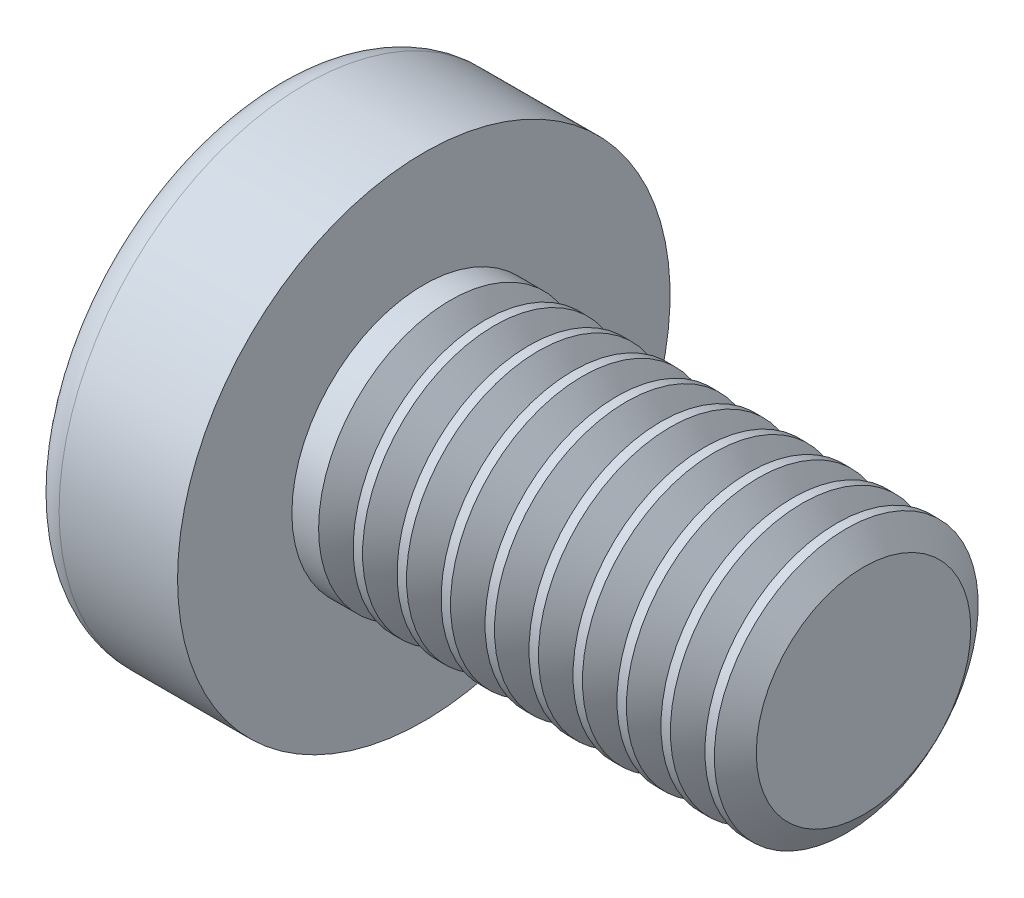
ISO-10303-21;
HEADER;
FILE_DESCRIPTION(('STEP AP214'),'2;1');
FILE_NAME('part.step','',(''),(''),'','','');
FILE_SCHEMA(('AUTOMOTIVE_DESIGN { 1 0 10303 214 1 1 1 1 }'));
ENDSEC;
DATA;
#1=APPLICATION_CONTEXT('core data for automotive mechanical design processes');
#2=APPLICATION_PROTOCOL_DEFINITION('international standard','automotive_design',2000,#1);
#3=PRODUCT_CONTEXT('',#1,'mechanical');
#4=PRODUCT('Part','Part','',(#3));
#5=PRODUCT_RELATED_PRODUCT_CATEGORY('part','',(#4));
#6=PRODUCT_DEFINITION_FORMATION('','',#4);
#7=PRODUCT_DEFINITION_CONTEXT('part definition',#1,'design');
#8=PRODUCT_DEFINITION('design','',#6,#7);
#9=PRODUCT_DEFINITION_SHAPE('','',#8);
#10=(LENGTH_UNIT() NAMED_UNIT(*) SI_UNIT(.MILLI.,.METRE.));
#11=(NAMED_UNIT(*) PLANE_ANGLE_UNIT() SI_UNIT($,.RADIAN.));
#12=(NAMED_UNIT(*) SI_UNIT($,.STERADIAN.) SOLID_ANGLE_UNIT());
#13=UNCERTAINTY_MEASURE_WITH_UNIT(LENGTH_MEASURE(1.E-05),#10,'distance_accuracy_value','');
#14=(GEOMETRIC_REPRESENTATION_CONTEXT(3) GLOBAL_UNCERTAINTY_ASSIGNED_CONTEXT((#13)) GLOBAL_UNIT_ASSIGNED_CONTEXT((#10,
#11,#12)) REPRESENTATION_CONTEXT('',''));
#15=CARTESIAN_POINT('',(0.,0.,0.));
#16=DIRECTION('',(0.,0.,1.));
#17=DIRECTION('',(1.,0.,0.));
#18=AXIS2_PLACEMENT_3D('',#15,#16,#17);
#19=CARTESIAN_POINT('',(5.,0.,0.));
#20=DIRECTION('',(-1.,0.,0.));
#21=DIRECTION('',(0.,1.,0.));
#22=AXIS2_PLACEMENT_3D('',#19,#20,#21);
#23=SPHERICAL_SURFACE('',#22,5.);
#24=CARTESIAN_POINT('',(0.74715070681048,0.,0.));
#25=DIRECTION('',(-1.,0.,0.));
#26=DIRECTION('',(0.,0.,1.));
#27=AXIS2_PLACEMENT_3D('',#24,#25,#26);
#28=CIRCLE('',#27,2.62931034482758);
#29=CARTESIAN_POINT('',(0.74715070681048,0.,2.62931034482758));
#30=VERTEX_POINT('',#29);
#31=EDGE_CURVE('E134',#30,#30,#28,.T.);
#32=ORIENTED_EDGE('',*,*,#31,.T.);
#33=EDGE_LOOP('',(#32));
#34=FACE_BOUND('',#33,.T.);
#35=CARTESIAN_POINT('',(4.98382636322272,-0.153868112043298,0.));
#36=DIRECTION('',(-0.104537710696287,-0.994520923380891,0.));
#37=DIRECTION('',(0.994520923380891,-0.104537710696287,0.));
#38=AXIS2_PLACEMENT_3D('',#35,#36,#37);
#39=CIRCLE('',#38,4.99760572850336);
#40=CARTESIAN_POINT('',(0.188596138461545,0.350175974082162,1.31444652548076));
#41=VERTEX_POINT('',#40);
#42=CARTESIAN_POINT('',(0.0270341343313624,0.367158343834486,0.367158343834487));
#43=VERTEX_POINT('',#42);
#44=EDGE_CURVE('E165',#41,#43,#39,.T.);
#45=ORIENTED_EDGE('',*,*,#44,.F.);
#46=CARTESIAN_POINT('',(3.98403090792016,0.,-1.41352221506761));
#47=DIRECTION('',(0.583636048152575,0.,0.812015371342713));
#48=DIRECTION('',(0.812015371342714,0.,-0.583636048152575));
#49=AXIS2_PLACEMENT_3D('',#46,#47,#48);
#50=CIRCLE('',#49,4.68719124331927);
#51=CARTESIAN_POINT('',(0.188596138461545,-0.350175974082171,1.31444652548076));
#52=VERTEX_POINT('',#51);
#53=EDGE_CURVE('E133',#41,#52,#50,.T.);
#54=ORIENTED_EDGE('',*,*,#53,.T.);
#55=CARTESIAN_POINT('',(4.98382636322272,0.153868112043297,0.));
#56=DIRECTION('',(-0.104537710696287,0.994520923380891,0.));
#57=DIRECTION('',(-0.994520923380891,-0.104537710696287,0.));
#58=AXIS2_PLACEMENT_3D('',#55,#56,#57);
#59=CIRCLE('',#58,4.99760572850336);
#60=CARTESIAN_POINT('',(0.0270341343313616,-0.367158343834489,0.367158343834487));
#61=VERTEX_POINT('',#60);
#62=EDGE_CURVE('E89',#61,#52,#59,.T.);
#63=ORIENTED_EDGE('',*,*,#62,.F.);
#64=CARTESIAN_POINT('',(4.98382636322272,0.,-0.153868112043297));
#65=DIRECTION('',(-0.104537710696287,0.,-0.994520923380891));
#66=DIRECTION('',(-0.994520923380891,0.,0.104537710696287));
#67=AXIS2_PLACEMENT_3D('',#64,#65,#66);
#68=CIRCLE('',#67,4.99760572850336);
#69=CARTESIAN_POINT('',(0.188596138461543,-1.31444652548077,0.350175974082167));
#70=VERTEX_POINT('',#69);
#71=EDGE_CURVE('E114',#70,#61,#68,.T.);
#72=ORIENTED_EDGE('',*,*,#71,.F.);
#73=CARTESIAN_POINT('',(3.98403090792016,1.41352221506761,0.));
#74=DIRECTION('',(0.583636048152575,-0.812015371342713,0.));
#75=DIRECTION('',(0.812015371342714,0.583636048152575,0.));
#76=AXIS2_PLACEMENT_3D('',#73,#74,#75);
#77=CIRCLE('',#76,4.68719124331927);
#78=CARTESIAN_POINT('',(0.188596138461543,-1.31444652548077,-0.350175974082167));
#79=VERTEX_POINT('',#78);
#80=EDGE_CURVE('E122',#70,#79,#77,.T.);
#81=ORIENTED_EDGE('',*,*,#80,.T.);
#82=CARTESIAN_POINT('',(4.98382636322272,0.,0.153868112043298));
#83=DIRECTION('',(-0.104537710696287,0.,0.994520923380891));
#84=DIRECTION('',(0.994520923380891,0.,0.104537710696287));
#85=AXIS2_PLACEMENT_3D('',#82,#83,#84);
#86=CIRCLE('',#85,4.99760572850336);
#87=CARTESIAN_POINT('',(0.0270341343313616,-0.367158343834486,-0.367158343834487));
#88=VERTEX_POINT('',#87);
#89=EDGE_CURVE('E32',#88,#79,#86,.T.);
#90=ORIENTED_EDGE('',*,*,#89,.F.);
#91=CARTESIAN_POINT('',(0.188596138461545,-0.350175974082162,-1.31444652548077));
#92=VERTEX_POINT('',#91);
#93=EDGE_CURVE('E172',#92,#88,#59,.T.);
#94=ORIENTED_EDGE('',*,*,#93,.F.);
#95=CARTESIAN_POINT('',(3.98403090792016,0.,1.41352221506761));
#96=DIRECTION('',(0.583636048152575,0.,-0.812015371342713));
#97=DIRECTION('',(-0.812015371342714,0.,-0.583636048152575));
#98=AXIS2_PLACEMENT_3D('',#95,#96,#97);
#99=CIRCLE('',#98,4.68719124331927);
#100=CARTESIAN_POINT('',(0.188596138461545,0.350175974082172,-1.31444652548076));
#101=VERTEX_POINT('',#100);
#102=EDGE_CURVE('E115',#92,#101,#99,.T.);
#103=ORIENTED_EDGE('',*,*,#102,.T.);
#104=CARTESIAN_POINT('',(0.0270341343313624,0.367158343834489,-0.367158343834487));
#105=VERTEX_POINT('',#104);
#106=EDGE_CURVE('E160',#105,#101,#39,.T.);
#107=ORIENTED_EDGE('',*,*,#106,.F.);
#108=CARTESIAN_POINT('',(0.188596138461545,1.31444652548076,-0.350175974082167));
#109=VERTEX_POINT('',#108);
#110=EDGE_CURVE('E25',#109,#105,#86,.T.);
#111=ORIENTED_EDGE('',*,*,#110,.F.);
#112=CARTESIAN_POINT('',(3.98403090792016,-1.41352221506761,0.));
#113=DIRECTION('',(0.583636048152575,0.812015371342713,0.));
#114=DIRECTION('',(-0.812015371342714,0.583636048152575,0.));
#115=AXIS2_PLACEMENT_3D('',#112,#113,#114);
#116=CIRCLE('',#115,4.68719124331927);
#117=CARTESIAN_POINT('',(0.188596138461545,1.31444652548076,0.350175974082167));
#118=VERTEX_POINT('',#117);
#119=EDGE_CURVE('E11',#109,#118,#116,.T.);
#120=ORIENTED_EDGE('',*,*,#119,.T.);
#121=EDGE_CURVE('E148',#43,#118,#68,.T.);
#122=ORIENTED_EDGE('',*,*,#121,.F.);
#123=EDGE_LOOP('',(#45,#54,#63,#72,#81,#90,#94,#103,#107,#111,#120,#122));
#124=FACE_BOUND('',#123,.T.);
#125=ADVANCED_FACE('F17',(#34,#124),#23,.T.);
#126=CARTESIAN_POINT('',(2.01739130434783,0.,-0.157944664031621));
#127=DIRECTION('',(-0.104537710696287,0.,0.994520923380891));
#128=DIRECTION('',(0.994520923380891,0.,0.104537710696287));
#129=AXIS2_PLACEMENT_3D('',#126,#127,#128);
#130=PLANE('',#129);
#131=ORIENTED_EDGE('',*,*,#110,.T.);
#132=DIRECTION('',(0.989130931836555,-0.103971149085093,0.103971149085092));
#133=VECTOR('',#132,1.);
#134=CARTESIAN_POINT('',(2.03363450411053,0.156237282238383,-0.156237282238382));
#135=LINE('',#134,#133);
#136=CARTESIAN_POINT('',(1.76,0.185,-0.185));
#137=VERTEX_POINT('',#136);
#138=EDGE_CURVE('E154',#105,#137,#135,.T.);
#139=ORIENTED_EDGE('',*,*,#138,.T.);
#140=DIRECTION('',(0.809073553388531,-0.581521616498006,0.0850446632823171));
#141=VECTOR('',#140,1.);
#142=CARTESIAN_POINT('',(0.,1.45,-0.37));
#143=LINE('',#142,#141);
#144=EDGE_CURVE('E138',#109,#137,#143,.T.);
#145=ORIENTED_EDGE('',*,*,#144,.F.);
#146=EDGE_LOOP('',(#131,#139,#145));
#147=FACE_BOUND('',#146,.T.);
#148=ADVANCED_FACE('F153',(#147),#130,.T.);
#149=DIRECTION('',(0.809073553388531,0.581521616498006,0.0850446632823171));
#150=VECTOR('',#149,1.);
#151=CARTESIAN_POINT('',(0.,-1.45,-0.37));
#152=LINE('',#151,#150);
#153=CARTESIAN_POINT('',(1.76,-0.185,-0.185));
#154=VERTEX_POINT('',#153);
#155=EDGE_CURVE('E123',#79,#154,#152,.T.);
#156=ORIENTED_EDGE('',*,*,#155,.T.);
#157=DIRECTION('',(-0.989130931836555,-0.103971149085092,-0.103971149085092));
#158=VECTOR('',#157,1.);
#159=CARTESIAN_POINT('',(2.03363450411053,-0.156237282238382,-0.156237282238382));
#160=LINE('',#159,#158);
#161=EDGE_CURVE('E175',#154,#88,#160,.T.);
#162=ORIENTED_EDGE('',*,*,#161,.T.);
#163=ORIENTED_EDGE('',*,*,#89,.T.);
#164=EDGE_LOOP('',(#156,#162,#163));
#165=FACE_BOUND('',#164,.T.);
#166=ADVANCED_FACE('F291',(#165),#130,.T.);
#167=CARTESIAN_POINT('',(2.01739130434783,0.,0.157944664031621));
#168=DIRECTION('',(-0.104537710696287,0.,-0.994520923380891));
#169=DIRECTION('',(-0.994520923380891,0.,0.104537710696287));
#170=AXIS2_PLACEMENT_3D('',#167,#168,#169);
#171=PLANE('',#170);
#172=DIRECTION('',(0.809073553388531,-0.581521616498006,-0.085044663282317));
#173=VECTOR('',#172,1.);
#174=CARTESIAN_POINT('',(0.,1.45,0.37));
#175=LINE('',#174,#173);
#176=CARTESIAN_POINT('',(1.76,0.185,0.185));
#177=VERTEX_POINT('',#176);
#178=EDGE_CURVE('E741',#118,#177,#175,.T.);
#179=ORIENTED_EDGE('',*,*,#178,.T.);
#180=DIRECTION('',(-0.989130931836555,0.103971149085092,0.103971149085092));
#181=VECTOR('',#180,1.);
#182=CARTESIAN_POINT('',(2.03363450411053,0.156237282238381,0.156237282238383));
#183=LINE('',#182,#181);
#184=EDGE_CURVE('E169',#177,#43,#183,.T.);
#185=ORIENTED_EDGE('',*,*,#184,.T.);
#186=ORIENTED_EDGE('',*,*,#121,.T.);
#187=EDGE_LOOP('',(#179,#185,#186));
#188=FACE_BOUND('',#187,.T.);
#189=ADVANCED_FACE('F321',(#188),#171,.T.);
#190=ORIENTED_EDGE('',*,*,#71,.T.);
#191=DIRECTION('',(0.989130931836555,0.103971149085092,-0.103971149085092));
#192=VECTOR('',#191,1.);
#193=CARTESIAN_POINT('',(2.03363450411053,-0.156237282238383,0.156237282238383));
#194=LINE('',#193,#192);
#195=CARTESIAN_POINT('',(1.76,-0.185,0.185));
#196=VERTEX_POINT('',#195);
#197=EDGE_CURVE('E87',#61,#196,#194,.T.);
#198=ORIENTED_EDGE('',*,*,#197,.T.);
#199=DIRECTION('',(0.809073553388531,0.581521616498006,-0.0850446632823169));
#200=VECTOR('',#199,1.);
#201=CARTESIAN_POINT('',(0.,-1.45,0.37));
#202=LINE('',#201,#200);
#203=EDGE_CURVE('E112',#70,#196,#202,.T.);
#204=ORIENTED_EDGE('',*,*,#203,.F.);
#205=EDGE_LOOP('',(#190,#198,#204));
#206=FACE_BOUND('',#205,.T.);
#207=ADVANCED_FACE('F111',(#206),#171,.T.);
#208=CARTESIAN_POINT('',(-25.4,0.,0.));
#209=DIRECTION('',(-1.,0.,0.));
#210=DIRECTION('',(0.,0.,1.));
#211=AXIS2_PLACEMENT_3D('',#208,#209,#210);
#212=CYLINDRICAL_SURFACE('',#211,1.5);
#213=CARTESIAN_POINT('',(2.70359178553217,0.,0.));
#214=DIRECTION('',(-1.,0.,0.));
#215=DIRECTION('',(0.,-1.,0.));
#216=AXIS2_PLACEMENT_3D('',#213,#214,#215);
#217=CIRCLE('',#216,1.5);
#218=CARTESIAN_POINT('',(2.70359178553217,-1.5,0.));
#219=VERTEX_POINT('',#218);
#220=EDGE_CURVE('E187',#219,#219,#217,.T.);
#221=ORIENTED_EDGE('',*,*,#220,.T.);
#222=EDGE_LOOP('',(#221));
#223=FACE_BOUND('',#222,.T.);
#224=CARTESIAN_POINT('',(2.4,0.,0.));
#225=DIRECTION('',(-1.,0.,0.));
#226=DIRECTION('',(0.,0.,1.));
#227=AXIS2_PLACEMENT_3D('',#224,#225,#226);
#228=CIRCLE('',#227,1.5);
#229=CARTESIAN_POINT('',(2.4,0.,1.5));
#230=VERTEX_POINT('',#229);
#231=EDGE_CURVE('E144',#230,#230,#228,.T.);
#232=ORIENTED_EDGE('',*,*,#231,.F.);
#233=EDGE_LOOP('',(#232));
#234=FACE_BOUND('',#233,.T.);
#235=ADVANCED_FACE('F19',(#223,#234),#212,.T.);
#236=CARTESIAN_POINT('',(2.4,1.5,0.));
#237=DIRECTION('',(-1.,0.,0.));
#238=DIRECTION('',(0.,0.,1.));
#239=AXIS2_PLACEMENT_3D('',#236,#237,#238);
#240=PLANE('',#239);
#241=CARTESIAN_POINT('',(2.4,0.,0.));
#242=DIRECTION('',(-1.,0.,0.));
#243=DIRECTION('',(0.,0.,1.));
#244=AXIS2_PLACEMENT_3D('',#241,#242,#243);
#245=CIRCLE('',#244,2.8);
#246=CARTESIAN_POINT('',(2.4,0.,2.8));
#247=VERTEX_POINT('',#246);
#248=EDGE_CURVE('E141',#247,#247,#245,.T.);
#249=ORIENTED_EDGE('',*,*,#248,.F.);
#250=EDGE_LOOP('',(#249));
#251=FACE_BOUND('',#250,.T.);
#252=ORIENTED_EDGE('',*,*,#231,.T.);
#253=EDGE_LOOP('',(#252));
#254=FACE_BOUND('',#253,.T.);
#255=ADVANCED_FACE('F301',(#251,#254),#240,.F.);
#256=CARTESIAN_POINT('',(-25.4,0.,0.));
#257=DIRECTION('',(-1.,0.,0.));
#258=DIRECTION('',(0.,0.,1.));
#259=AXIS2_PLACEMENT_3D('',#256,#257,#258);
#260=CYLINDRICAL_SURFACE('',#259,2.8);
#261=ORIENTED_EDGE('',*,*,#248,.T.);
#262=EDGE_LOOP('',(#261));
#263=FACE_BOUND('',#262,.T.);
#264=CARTESIAN_POINT('',(1.05335585592012,0.,0.));
#265=DIRECTION('',(-1.,0.,0.));
#266=DIRECTION('',(0.,0.,1.));
#267=AXIS2_PLACEMENT_3D('',#264,#265,#266);
#268=CIRCLE('',#267,2.8);
#269=CARTESIAN_POINT('',(1.05335585592012,0.,2.8));
#270=VERTEX_POINT('',#269);
#271=EDGE_CURVE('E137',#270,#270,#268,.T.);
#272=ORIENTED_EDGE('',*,*,#271,.F.);
#273=EDGE_LOOP('',(#272));
#274=FACE_BOUND('',#273,.T.);
#275=ADVANCED_FACE('F298',(#263,#274),#260,.T.);
#276=CARTESIAN_POINT('',(1.05335585592012,0.,0.));
#277=DIRECTION('',(-1.,0.,0.));
#278=DIRECTION('',(0.,0.,1.));
#279=AXIS2_PLACEMENT_3D('',#276,#277,#278);
#280=TOROIDAL_SURFACE('',#279,2.44,0.36);
#281=ORIENTED_EDGE('',*,*,#271,.T.);
#282=EDGE_LOOP('',(#281));
#283=FACE_BOUND('',#282,.T.);
#284=ORIENTED_EDGE('',*,*,#31,.F.);
#285=EDGE_LOOP('',(#284));
#286=FACE_BOUND('',#285,.T.);
#287=ADVANCED_FACE('F294',(#283,#286),#280,.T.);
#288=CARTESIAN_POINT('',(1.76,0.185,0.185));
#289=DIRECTION('',(0.583636048152575,0.812015371342713,0.));
#290=DIRECTION('',(-0.812015371342714,0.583636048152575,0.));
#291=AXIS2_PLACEMENT_3D('',#288,#289,#290);
#292=PLANE('',#291);
#293=ORIENTED_EDGE('',*,*,#144,.T.);
#294=DIRECTION('',(0.,0.,-1.));
#295=VECTOR('',#294,1.);
#296=CARTESIAN_POINT('',(1.76,0.185,0.185));
#297=LINE('',#296,#295);
#298=EDGE_CURVE('E105',#177,#137,#297,.T.);
#299=ORIENTED_EDGE('',*,*,#298,.F.);
#300=ORIENTED_EDGE('',*,*,#178,.F.);
#301=ORIENTED_EDGE('',*,*,#119,.F.);
#302=EDGE_LOOP('',(#293,#299,#300,#301));
#303=FACE_BOUND('',#302,.T.);
#304=ADVANCED_FACE('F297',(#303),#292,.F.);
#305=CARTESIAN_POINT('',(1.76,-0.185,-0.185));
#306=DIRECTION('',(0.583636048152575,-0.812015371342713,0.));
#307=DIRECTION('',(0.812015371342714,0.583636048152575,0.));
#308=AXIS2_PLACEMENT_3D('',#305,#306,#307);
#309=PLANE('',#308);
#310=ORIENTED_EDGE('',*,*,#203,.T.);
#311=DIRECTION('',(0.,0.,1.));
#312=VECTOR('',#311,1.);
#313=CARTESIAN_POINT('',(1.76,-0.185,-0.185));
#314=LINE('',#313,#312);
#315=EDGE_CURVE('E104',#154,#196,#314,.T.);
#316=ORIENTED_EDGE('',*,*,#315,.F.);
#317=ORIENTED_EDGE('',*,*,#155,.F.);
#318=ORIENTED_EDGE('',*,*,#80,.F.);
#319=EDGE_LOOP('',(#310,#316,#317,#318));
#320=FACE_BOUND('',#319,.T.);
#321=ADVANCED_FACE('F119',(#320),#309,.F.);
#322=CARTESIAN_POINT('',(1.76,-0.185,-0.185));
#323=DIRECTION('',(1.,0.,0.));
#324=DIRECTION('',(0.,0.,-1.));
#325=AXIS2_PLACEMENT_3D('',#322,#323,#324);
#326=PLANE('',#325);
#327=DIRECTION('',(0.,1.,0.));
#328=VECTOR('',#327,1.);
#329=CARTESIAN_POINT('',(1.76,-0.185,-0.185));
#330=LINE('',#329,#328);
#331=EDGE_CURVE('E127',#154,#137,#330,.T.);
#332=ORIENTED_EDGE('',*,*,#331,.F.);
#333=ORIENTED_EDGE('',*,*,#315,.T.);
#334=DIRECTION('',(0.,-1.,0.));
#335=VECTOR('',#334,1.);
#336=CARTESIAN_POINT('',(1.76,0.185,0.185));
#337=LINE('',#336,#335);
#338=EDGE_CURVE('E96',#177,#196,#337,.T.);
#339=ORIENTED_EDGE('',*,*,#338,.F.);
#340=ORIENTED_EDGE('',*,*,#298,.T.);
#341=EDGE_LOOP('',(#332,#333,#339,#340));
#342=FACE_BOUND('',#341,.T.);
#343=ADVANCED_FACE('F125',(#342),#326,.F.);
#344=CARTESIAN_POINT('',(1.76,0.185,-0.185));
#345=DIRECTION('',(0.583636048152575,0.,-0.812015371342713));
#346=DIRECTION('',(0.812015371342714,0.,0.583636048152575));
#347=AXIS2_PLACEMENT_3D('',#344,#345,#346);
#348=PLANE('',#347);
#349=DIRECTION('',(0.809073553388531,0.0850446632823149,0.581521616498007));
#350=VECTOR('',#349,1.);
#351=CARTESIAN_POINT('',(0.,-0.369999999999994,-1.45));
#352=LINE('',#351,#350);
#353=EDGE_CURVE('E180',#92,#154,#352,.T.);
#354=ORIENTED_EDGE('',*,*,#353,.T.);
#355=ORIENTED_EDGE('',*,*,#331,.T.);
#356=DIRECTION('',(0.809073553388531,-0.0850446632823192,0.581521616498006));
#357=VECTOR('',#356,1.);
#358=CARTESIAN_POINT('',(0.,0.370000000000005,-1.45));
#359=LINE('',#358,#357);
#360=EDGE_CURVE('E93',#101,#137,#359,.T.);
#361=ORIENTED_EDGE('',*,*,#360,.F.);
#362=ORIENTED_EDGE('',*,*,#102,.F.);
#363=EDGE_LOOP('',(#354,#355,#361,#362));
#364=FACE_BOUND('',#363,.T.);
#365=ADVANCED_FACE('F464',(#364),#348,.F.);
#366=CARTESIAN_POINT('',(2.01739130434783,-0.157944664031621,0.));
#367=DIRECTION('',(-0.104537710696287,0.994520923380891,0.));
#368=DIRECTION('',(-0.994520923380891,-0.104537710696287,0.));
#369=AXIS2_PLACEMENT_3D('',#366,#367,#368);
#370=PLANE('',#369);
#371=ORIENTED_EDGE('',*,*,#93,.T.);
#372=ORIENTED_EDGE('',*,*,#161,.F.);
#373=ORIENTED_EDGE('',*,*,#353,.F.);
#374=EDGE_LOOP('',(#371,#372,#373));
#375=FACE_BOUND('',#374,.T.);
#376=ADVANCED_FACE('F461',(#375),#370,.T.);
#377=CARTESIAN_POINT('',(2.01739130434783,0.157944664031621,0.));
#378=DIRECTION('',(-0.104537710696287,-0.994520923380891,0.));
#379=DIRECTION('',(0.994520923380891,-0.104537710696287,0.));
#380=AXIS2_PLACEMENT_3D('',#377,#378,#379);
#381=PLANE('',#380);
#382=ORIENTED_EDGE('',*,*,#106,.T.);
#383=ORIENTED_EDGE('',*,*,#360,.T.);
#384=ORIENTED_EDGE('',*,*,#138,.F.);
#385=EDGE_LOOP('',(#382,#383,#384));
#386=FACE_BOUND('',#385,.T.);
#387=ADVANCED_FACE('F458',(#386),#381,.T.);
#388=CARTESIAN_POINT('',(1.76,-0.185,0.185));
#389=DIRECTION('',(0.583636048152575,0.,0.812015371342713));
#390=DIRECTION('',(-0.812015371342714,0.,0.583636048152575));
#391=AXIS2_PLACEMENT_3D('',#388,#389,#390);
#392=PLANE('',#391);
#393=DIRECTION('',(0.809073553388531,-0.0850446632823151,-0.581521616498007));
#394=VECTOR('',#393,1.);
#395=CARTESIAN_POINT('',(0.,0.369999999999995,1.45));
#396=LINE('',#395,#394);
#397=EDGE_CURVE('E92',#41,#177,#396,.T.);
#398=ORIENTED_EDGE('',*,*,#397,.T.);
#399=ORIENTED_EDGE('',*,*,#338,.T.);
#400=DIRECTION('',(0.809073553388531,0.085044663282319,-0.581521616498006));
#401=VECTOR('',#400,1.);
#402=CARTESIAN_POINT('',(0.,-0.370000000000005,1.45));
#403=LINE('',#402,#401);
#404=EDGE_CURVE('E83',#52,#196,#403,.T.);
#405=ORIENTED_EDGE('',*,*,#404,.F.);
#406=ORIENTED_EDGE('',*,*,#53,.F.);
#407=EDGE_LOOP('',(#398,#399,#405,#406));
#408=FACE_BOUND('',#407,.T.);
#409=ADVANCED_FACE('F97',(#408),#392,.F.);
#410=ORIENTED_EDGE('',*,*,#44,.T.);
#411=ORIENTED_EDGE('',*,*,#184,.F.);
#412=ORIENTED_EDGE('',*,*,#397,.F.);
#413=EDGE_LOOP('',(#410,#411,#412));
#414=FACE_BOUND('',#413,.T.);
#415=ADVANCED_FACE('F457',(#414),#381,.T.);
#416=ORIENTED_EDGE('',*,*,#62,.T.);
#417=ORIENTED_EDGE('',*,*,#404,.T.);
#418=ORIENTED_EDGE('',*,*,#197,.F.);
#419=EDGE_LOOP('',(#416,#417,#418));
#420=FACE_BOUND('',#419,.T.);
#421=ADVANCED_FACE('F85',(#420),#370,.T.);
#422=CARTESIAN_POINT('',(3.09640821446782,0.,0.));
#423=DIRECTION('',(1.,0.,0.));
#424=DIRECTION('',(0.,1.,0.));
#425=AXIS2_PLACEMENT_3D('',#422,#423,#424);
#426=CONICAL_SURFACE('',#425,1.5,0.959931088596883);
#427=CARTESIAN_POINT('',(2.9,0.,0.));
#428=DIRECTION('',(-1.,0.,0.));
#429=DIRECTION('',(0.,-1.,0.));
#430=AXIS2_PLACEMENT_3D('',#427,#428,#429);
#431=CIRCLE('',#430,1.2195);
#432=CARTESIAN_POINT('',(2.9,-1.2195,0.));
#433=VERTEX_POINT('',#432);
#434=EDGE_CURVE('E190',#433,#433,#431,.T.);
#435=ORIENTED_EDGE('',*,*,#434,.F.);
#436=EDGE_LOOP('',(#435));
#437=FACE_BOUND('',#436,.T.);
#438=CARTESIAN_POINT('',(3.09640821446782,0.,0.));
#439=DIRECTION('',(-1.,0.,0.));
#440=DIRECTION('',(0.,-1.,0.));
#441=AXIS2_PLACEMENT_3D('',#438,#439,#440);
#442=CIRCLE('',#441,1.5);
#443=CARTESIAN_POINT('',(3.09640821446782,-1.5,0.));
#444=VERTEX_POINT('',#443);
#445=EDGE_CURVE('E182',#444,#444,#442,.T.);
#446=ORIENTED_EDGE('',*,*,#445,.T.);
#447=EDGE_LOOP('',(#446));
#448=FACE_BOUND('',#447,.T.);
#449=ADVANCED_FACE('F339',(#437,#448),#426,.T.);
#450=CARTESIAN_POINT('',(2.9,0.,0.));
#451=DIRECTION('',(-1.,0.,0.));
#452=DIRECTION('',(0.,-1.,0.));
#453=AXIS2_PLACEMENT_3D('',#450,#451,#452);
#454=CONICAL_SURFACE('',#453,1.2195,0.959931088596875);
#455=ORIENTED_EDGE('',*,*,#220,.F.);
#456=EDGE_LOOP('',(#455));
#457=FACE_BOUND('',#456,.T.);
#458=ORIENTED_EDGE('',*,*,#434,.T.);
#459=EDGE_LOOP('',(#458));
#460=FACE_BOUND('',#459,.T.);
#461=ADVANCED_FACE('F329',(#457,#460),#454,.T.);
#462=CARTESIAN_POINT('',(3.20359178553217,0.,0.));
#463=DIRECTION('',(-1.,0.,0.));
#464=DIRECTION('',(0.,-1.,0.));
#465=AXIS2_PLACEMENT_3D('',#462,#463,#464);
#466=CIRCLE('',#465,1.5);
#467=CARTESIAN_POINT('',(3.20359178553217,-1.5,0.));
#468=VERTEX_POINT('',#467);
#469=EDGE_CURVE('E196',#468,#468,#466,.T.);
#470=ORIENTED_EDGE('',*,*,#469,.T.);
#471=EDGE_LOOP('',(#470));
#472=FACE_BOUND('',#471,.T.);
#473=ORIENTED_EDGE('',*,*,#445,.F.);
#474=EDGE_LOOP('',(#473));
#475=FACE_BOUND('',#474,.T.);
#476=ADVANCED_FACE('F309',(#472,#475),#212,.T.);
#477=CARTESIAN_POINT('',(3.59640821446782,0.,0.));
#478=DIRECTION('',(1.,0.,0.));
#479=DIRECTION('',(0.,1.,0.));
#480=AXIS2_PLACEMENT_3D('',#477,#478,#479);
#481=CONICAL_SURFACE('',#480,1.5,0.959931088596883);
#482=CARTESIAN_POINT('',(3.4,0.,0.));
#483=DIRECTION('',(-1.,0.,0.));
#484=DIRECTION('',(0.,-1.,0.));
#485=AXIS2_PLACEMENT_3D('',#482,#483,#484);
#486=CIRCLE('',#485,1.2195);
#487=CARTESIAN_POINT('',(3.4,-1.2195,0.));
#488=VERTEX_POINT('',#487);
#489=EDGE_CURVE('E199',#488,#488,#486,.T.);
#490=ORIENTED_EDGE('',*,*,#489,.F.);
#491=EDGE_LOOP('',(#490));
#492=FACE_BOUND('',#491,.T.);
#493=CARTESIAN_POINT('',(3.59640821446782,0.,0.));
#494=DIRECTION('',(-1.,0.,0.));
#495=DIRECTION('',(0.,-1.,0.));
#496=AXIS2_PLACEMENT_3D('',#493,#494,#495);
#497=CIRCLE('',#496,1.5);
#498=CARTESIAN_POINT('',(3.59640821446782,-1.5,0.));
#499=VERTEX_POINT('',#498);
#500=EDGE_CURVE('E193',#499,#499,#497,.T.);
#501=ORIENTED_EDGE('',*,*,#500,.T.);
#502=EDGE_LOOP('',(#501));
#503=FACE_BOUND('',#502,.T.);
#504=ADVANCED_FACE('F328',(#492,#503),#481,.T.);
#505=CARTESIAN_POINT('',(3.4,0.,0.));
#506=DIRECTION('',(-1.,0.,0.));
#507=DIRECTION('',(0.,-1.,0.));
#508=AXIS2_PLACEMENT_3D('',#505,#506,#507);
#509=CONICAL_SURFACE('',#508,1.2195,0.959931088596875);
#510=ORIENTED_EDGE('',*,*,#469,.F.);
#511=EDGE_LOOP('',(#510));
#512=FACE_BOUND('',#511,.T.);
#513=ORIENTED_EDGE('',*,*,#489,.T.);
#514=EDGE_LOOP('',(#513));
#515=FACE_BOUND('',#514,.T.);
#516=ADVANCED_FACE('F336',(#512,#515),#509,.T.);
#517=CARTESIAN_POINT('',(3.70359178553217,0.,0.));
#518=DIRECTION('',(-1.,0.,0.));
#519=DIRECTION('',(0.,-1.,0.));
#520=AXIS2_PLACEMENT_3D('',#517,#518,#519);
#521=CIRCLE('',#520,1.5);
#522=CARTESIAN_POINT('',(3.70359178553217,-1.5,0.));
#523=VERTEX_POINT('',#522);
#524=EDGE_CURVE('E205',#523,#523,#521,.T.);
#525=ORIENTED_EDGE('',*,*,#524,.T.);
#526=EDGE_LOOP('',(#525));
#527=FACE_BOUND('',#526,.T.);
#528=ORIENTED_EDGE('',*,*,#500,.F.);
#529=EDGE_LOOP('',(#528));
#530=FACE_BOUND('',#529,.T.);
#531=ADVANCED_FACE('F331',(#527,#530),#212,.T.);
#532=CARTESIAN_POINT('',(4.09640821446782,0.,0.));
#533=DIRECTION('',(1.,0.,0.));
#534=DIRECTION('',(0.,1.,0.));
#535=AXIS2_PLACEMENT_3D('',#532,#533,#534);
#536=CONICAL_SURFACE('',#535,1.5,0.959931088596883);
#537=CARTESIAN_POINT('',(3.9,0.,0.));
#538=DIRECTION('',(-1.,0.,0.));
#539=DIRECTION('',(0.,-1.,0.));
#540=AXIS2_PLACEMENT_3D('',#537,#538,#539);
#541=CIRCLE('',#540,1.2195);
#542=CARTESIAN_POINT('',(3.9,-1.2195,0.));
#543=VERTEX_POINT('',#542);
#544=EDGE_CURVE('E208',#543,#543,#541,.T.);
#545=ORIENTED_EDGE('',*,*,#544,.F.);
#546=EDGE_LOOP('',(#545));
#547=FACE_BOUND('',#546,.T.);
#548=CARTESIAN_POINT('',(4.09640821446782,0.,0.));
#549=DIRECTION('',(-1.,0.,0.));
#550=DIRECTION('',(0.,-1.,0.));
#551=AXIS2_PLACEMENT_3D('',#548,#549,#550);
#552=CIRCLE('',#551,1.5);
#553=CARTESIAN_POINT('',(4.09640821446782,-1.5,0.));
#554=VERTEX_POINT('',#553);
#555=EDGE_CURVE('E202',#554,#554,#552,.T.);
#556=ORIENTED_EDGE('',*,*,#555,.T.);
#557=EDGE_LOOP('',(#556));
#558=FACE_BOUND('',#557,.T.);
#559=ADVANCED_FACE('F344',(#547,#558),#536,.T.);
#560=CARTESIAN_POINT('',(3.9,0.,0.));
#561=DIRECTION('',(-1.,0.,0.));
#562=DIRECTION('',(0.,-1.,0.));
#563=AXIS2_PLACEMENT_3D('',#560,#561,#562);
#564=CONICAL_SURFACE('',#563,1.2195,0.959931088596875);
#565=ORIENTED_EDGE('',*,*,#524,.F.);
#566=EDGE_LOOP('',(#565));
#567=FACE_BOUND('',#566,.T.);
#568=ORIENTED_EDGE('',*,*,#544,.T.);
#569=EDGE_LOOP('',(#568));
#570=FACE_BOUND('',#569,.T.);
#571=ADVANCED_FACE('F351',(#567,#570),#564,.T.);
#572=CARTESIAN_POINT('',(4.20359178553217,0.,0.));
#573=DIRECTION('',(-1.,0.,0.));
#574=DIRECTION('',(0.,-1.,0.));
#575=AXIS2_PLACEMENT_3D('',#572,#573,#574);
#576=CIRCLE('',#575,1.5);
#577=CARTESIAN_POINT('',(4.20359178553217,-1.5,0.));
#578=VERTEX_POINT('',#577);
#579=EDGE_CURVE('E214',#578,#578,#576,.T.);
#580=ORIENTED_EDGE('',*,*,#579,.T.);
#581=EDGE_LOOP('',(#580));
#582=FACE_BOUND('',#581,.T.);
#583=ORIENTED_EDGE('',*,*,#555,.F.);
#584=EDGE_LOOP('',(#583));
#585=FACE_BOUND('',#584,.T.);
#586=ADVANCED_FACE('F346',(#582,#585),#212,.T.);
#587=CARTESIAN_POINT('',(4.59640821446782,0.,0.));
#588=DIRECTION('',(1.,0.,0.));
#589=DIRECTION('',(0.,1.,0.));
#590=AXIS2_PLACEMENT_3D('',#587,#588,#589);
#591=CONICAL_SURFACE('',#590,1.5,0.959931088596883);
#592=CARTESIAN_POINT('',(4.4,0.,0.));
#593=DIRECTION('',(-1.,0.,0.));
#594=DIRECTION('',(0.,-1.,0.));
#595=AXIS2_PLACEMENT_3D('',#592,#593,#594);
#596=CIRCLE('',#595,1.2195);
#597=CARTESIAN_POINT('',(4.4,-1.2195,0.));
#598=VERTEX_POINT('',#597);
#599=EDGE_CURVE('E217',#598,#598,#596,.T.);
#600=ORIENTED_EDGE('',*,*,#599,.F.);
#601=EDGE_LOOP('',(#600));
#602=FACE_BOUND('',#601,.T.);
#603=CARTESIAN_POINT('',(4.59640821446782,0.,0.));
#604=DIRECTION('',(-1.,0.,0.));
#605=DIRECTION('',(0.,-1.,0.));
#606=AXIS2_PLACEMENT_3D('',#603,#604,#605);
#607=CIRCLE('',#606,1.5);
#608=CARTESIAN_POINT('',(4.59640821446782,-1.5,0.));
#609=VERTEX_POINT('',#608);
#610=EDGE_CURVE('E211',#609,#609,#607,.T.);
#611=ORIENTED_EDGE('',*,*,#610,.T.);
#612=EDGE_LOOP('',(#611));
#613=FACE_BOUND('',#612,.T.);
#614=ADVANCED_FACE('F358',(#602,#613),#591,.T.);
#615=CARTESIAN_POINT('',(4.4,0.,0.));
#616=DIRECTION('',(-1.,0.,0.));
#617=DIRECTION('',(0.,-1.,0.));
#618=AXIS2_PLACEMENT_3D('',#615,#616,#617);
#619=CONICAL_SURFACE('',#618,1.2195,0.959931088596875);
#620=ORIENTED_EDGE('',*,*,#579,.F.);
#621=EDGE_LOOP('',(#620));
#622=FACE_BOUND('',#621,.T.);
#623=ORIENTED_EDGE('',*,*,#599,.T.);
#624=EDGE_LOOP('',(#623));
#625=FACE_BOUND('',#624,.T.);
#626=ADVANCED_FACE('F365',(#622,#625),#619,.T.);
#627=CARTESIAN_POINT('',(4.70359178553217,0.,0.));
#628=DIRECTION('',(-1.,0.,0.));
#629=DIRECTION('',(0.,-1.,0.));
#630=AXIS2_PLACEMENT_3D('',#627,#628,#629);
#631=CIRCLE('',#630,1.5);
#632=CARTESIAN_POINT('',(4.70359178553217,-1.5,0.));
#633=VERTEX_POINT('',#632);
#634=EDGE_CURVE('E223',#633,#633,#631,.T.);
#635=ORIENTED_EDGE('',*,*,#634,.T.);
#636=EDGE_LOOP('',(#635));
#637=FACE_BOUND('',#636,.T.);
#638=ORIENTED_EDGE('',*,*,#610,.F.);
#639=EDGE_LOOP('',(#638));
#640=FACE_BOUND('',#639,.T.);
#641=ADVANCED_FACE('F360',(#637,#640),#212,.T.);
#642=CARTESIAN_POINT('',(5.09640821446782,0.,0.));
#643=DIRECTION('',(1.,0.,0.));
#644=DIRECTION('',(0.,1.,0.));
#645=AXIS2_PLACEMENT_3D('',#642,#643,#644);
#646=CONICAL_SURFACE('',#645,1.5,0.959931088596883);
#647=CARTESIAN_POINT('',(4.9,0.,0.));
#648=DIRECTION('',(-1.,0.,0.));
#649=DIRECTION('',(0.,-1.,0.));
#650=AXIS2_PLACEMENT_3D('',#647,#648,#649);
#651=CIRCLE('',#650,1.2195);
#652=CARTESIAN_POINT('',(4.9,-1.2195,0.));
#653=VERTEX_POINT('',#652);
#654=EDGE_CURVE('E226',#653,#653,#651,.T.);
#655=ORIENTED_EDGE('',*,*,#654,.F.);
#656=EDGE_LOOP('',(#655));
#657=FACE_BOUND('',#656,.T.);
#658=CARTESIAN_POINT('',(5.09640821446782,0.,0.));
#659=DIRECTION('',(-1.,0.,0.));
#660=DIRECTION('',(0.,-1.,0.));
#661=AXIS2_PLACEMENT_3D('',#658,#659,#660);
#662=CIRCLE('',#661,1.5);
#663=CARTESIAN_POINT('',(5.09640821446782,-1.5,0.));
#664=VERTEX_POINT('',#663);
#665=EDGE_CURVE('E220',#664,#664,#662,.T.);
#666=ORIENTED_EDGE('',*,*,#665,.T.);
#667=EDGE_LOOP('',(#666));
#668=FACE_BOUND('',#667,.T.);
#669=ADVANCED_FACE('F372',(#657,#668),#646,.T.);
#670=CARTESIAN_POINT('',(4.9,0.,0.));
#671=DIRECTION('',(-1.,0.,0.));
#672=DIRECTION('',(0.,-1.,0.));
#673=AXIS2_PLACEMENT_3D('',#670,#671,#672);
#674=CONICAL_SURFACE('',#673,1.2195,0.959931088596875);
#675=ORIENTED_EDGE('',*,*,#634,.F.);
#676=EDGE_LOOP('',(#675));
#677=FACE_BOUND('',#676,.T.);
#678=ORIENTED_EDGE('',*,*,#654,.T.);
#679=EDGE_LOOP('',(#678));
#680=FACE_BOUND('',#679,.T.);
#681=ADVANCED_FACE('F379',(#677,#680),#674,.T.);
#682=CARTESIAN_POINT('',(5.20359178553217,0.,0.));
#683=DIRECTION('',(-1.,0.,0.));
#684=DIRECTION('',(0.,-1.,0.));
#685=AXIS2_PLACEMENT_3D('',#682,#683,#684);
#686=CIRCLE('',#685,1.5);
#687=CARTESIAN_POINT('',(5.20359178553217,-1.5,0.));
#688=VERTEX_POINT('',#687);
#689=EDGE_CURVE('E232',#688,#688,#686,.T.);
#690=ORIENTED_EDGE('',*,*,#689,.T.);
#691=EDGE_LOOP('',(#690));
#692=FACE_BOUND('',#691,.T.);
#693=ORIENTED_EDGE('',*,*,#665,.F.);
#694=EDGE_LOOP('',(#693));
#695=FACE_BOUND('',#694,.T.);
#696=ADVANCED_FACE('F374',(#692,#695),#212,.T.);
#697=CARTESIAN_POINT('',(5.59640821446782,0.,0.));
#698=DIRECTION('',(1.,0.,0.));
#699=DIRECTION('',(0.,1.,0.));
#700=AXIS2_PLACEMENT_3D('',#697,#698,#699);
#701=CONICAL_SURFACE('',#700,1.5,0.959931088596883);
#702=CARTESIAN_POINT('',(5.4,0.,0.));
#703=DIRECTION('',(-1.,0.,0.));
#704=DIRECTION('',(0.,-1.,0.));
#705=AXIS2_PLACEMENT_3D('',#702,#703,#704);
#706=CIRCLE('',#705,1.2195);
#707=CARTESIAN_POINT('',(5.4,-1.2195,0.));
#708=VERTEX_POINT('',#707);
#709=EDGE_CURVE('E235',#708,#708,#706,.T.);
#710=ORIENTED_EDGE('',*,*,#709,.F.);
#711=EDGE_LOOP('',(#710));
#712=FACE_BOUND('',#711,.T.);
#713=CARTESIAN_POINT('',(5.59640821446782,0.,0.));
#714=DIRECTION('',(-1.,0.,0.));
#715=DIRECTION('',(0.,-1.,0.));
#716=AXIS2_PLACEMENT_3D('',#713,#714,#715);
#717=CIRCLE('',#716,1.5);
#718=CARTESIAN_POINT('',(5.59640821446782,-1.5,0.));
#719=VERTEX_POINT('',#718);
#720=EDGE_CURVE('E229',#719,#719,#717,.T.);
#721=ORIENTED_EDGE('',*,*,#720,.T.);
#722=EDGE_LOOP('',(#721));
#723=FACE_BOUND('',#722,.T.);
#724=ADVANCED_FACE('F386',(#712,#723),#701,.T.);
#725=CARTESIAN_POINT('',(5.4,0.,0.));
#726=DIRECTION('',(-1.,0.,0.));
#727=DIRECTION('',(0.,-1.,0.));
#728=AXIS2_PLACEMENT_3D('',#725,#726,#727);
#729=CONICAL_SURFACE('',#728,1.2195,0.959931088596875);
#730=ORIENTED_EDGE('',*,*,#689,.F.);
#731=EDGE_LOOP('',(#730));
#732=FACE_BOUND('',#731,.T.);
#733=ORIENTED_EDGE('',*,*,#709,.T.);
#734=EDGE_LOOP('',(#733));
#735=FACE_BOUND('',#734,.T.);
#736=ADVANCED_FACE('F393',(#732,#735),#729,.T.);
#737=CARTESIAN_POINT('',(5.70359178553217,0.,0.));
#738=DIRECTION('',(-1.,0.,0.));
#739=DIRECTION('',(0.,-1.,0.));
#740=AXIS2_PLACEMENT_3D('',#737,#738,#739);
#741=CIRCLE('',#740,1.5);
#742=CARTESIAN_POINT('',(5.70359178553217,-1.5,0.));
#743=VERTEX_POINT('',#742);
#744=EDGE_CURVE('E241',#743,#743,#741,.T.);
#745=ORIENTED_EDGE('',*,*,#744,.T.);
#746=EDGE_LOOP('',(#745));
#747=FACE_BOUND('',#746,.T.);
#748=ORIENTED_EDGE('',*,*,#720,.F.);
#749=EDGE_LOOP('',(#748));
#750=FACE_BOUND('',#749,.T.);
#751=ADVANCED_FACE('F388',(#747,#750),#212,.T.);
#752=CARTESIAN_POINT('',(6.09640821446782,0.,0.));
#753=DIRECTION('',(1.,0.,0.));
#754=DIRECTION('',(0.,1.,0.));
#755=AXIS2_PLACEMENT_3D('',#752,#753,#754);
#756=CONICAL_SURFACE('',#755,1.5,0.959931088596883);
#757=CARTESIAN_POINT('',(5.9,0.,0.));
#758=DIRECTION('',(-1.,0.,0.));
#759=DIRECTION('',(0.,-1.,0.));
#760=AXIS2_PLACEMENT_3D('',#757,#758,#759);
#761=CIRCLE('',#760,1.2195);
#762=CARTESIAN_POINT('',(5.9,-1.2195,0.));
#763=VERTEX_POINT('',#762);
#764=EDGE_CURVE('E244',#763,#763,#761,.T.);
#765=ORIENTED_EDGE('',*,*,#764,.F.);
#766=EDGE_LOOP('',(#765));
#767=FACE_BOUND('',#766,.T.);
#768=CARTESIAN_POINT('',(6.09640821446782,0.,0.));
#769=DIRECTION('',(-1.,0.,0.));
#770=DIRECTION('',(0.,-1.,0.));
#771=AXIS2_PLACEMENT_3D('',#768,#769,#770);
#772=CIRCLE('',#771,1.5);
#773=CARTESIAN_POINT('',(6.09640821446782,-1.5,0.));
#774=VERTEX_POINT('',#773);
#775=EDGE_CURVE('E238',#774,#774,#772,.T.);
#776=ORIENTED_EDGE('',*,*,#775,.T.);
#777=EDGE_LOOP('',(#776));
#778=FACE_BOUND('',#777,.T.);
#779=ADVANCED_FACE('F400',(#767,#778),#756,.T.);
#780=CARTESIAN_POINT('',(5.9,0.,0.));
#781=DIRECTION('',(-1.,0.,0.));
#782=DIRECTION('',(0.,-1.,0.));
#783=AXIS2_PLACEMENT_3D('',#780,#781,#782);
#784=CONICAL_SURFACE('',#783,1.2195,0.959931088596875);
#785=ORIENTED_EDGE('',*,*,#744,.F.);
#786=EDGE_LOOP('',(#785));
#787=FACE_BOUND('',#786,.T.);
#788=ORIENTED_EDGE('',*,*,#764,.T.);
#789=EDGE_LOOP('',(#788));
#790=FACE_BOUND('',#789,.T.);
#791=ADVANCED_FACE('F407',(#787,#790),#784,.T.);
#792=CARTESIAN_POINT('',(6.20359178553217,0.,0.));
#793=DIRECTION('',(-1.,0.,0.));
#794=DIRECTION('',(0.,-1.,0.));
#795=AXIS2_PLACEMENT_3D('',#792,#793,#794);
#796=CIRCLE('',#795,1.5);
#797=CARTESIAN_POINT('',(6.20359178553217,-1.5,0.));
#798=VERTEX_POINT('',#797);
#799=EDGE_CURVE('E250',#798,#798,#796,.T.);
#800=ORIENTED_EDGE('',*,*,#799,.T.);
#801=EDGE_LOOP('',(#800));
#802=FACE_BOUND('',#801,.T.);
#803=ORIENTED_EDGE('',*,*,#775,.F.);
#804=EDGE_LOOP('',(#803));
#805=FACE_BOUND('',#804,.T.);
#806=ADVANCED_FACE('F402',(#802,#805),#212,.T.);
#807=CARTESIAN_POINT('',(6.59640821446782,0.,0.));
#808=DIRECTION('',(1.,0.,0.));
#809=DIRECTION('',(0.,1.,0.));
#810=AXIS2_PLACEMENT_3D('',#807,#808,#809);
#811=CONICAL_SURFACE('',#810,1.5,0.959931088596883);
#812=CARTESIAN_POINT('',(6.4,0.,0.));
#813=DIRECTION('',(-1.,0.,0.));
#814=DIRECTION('',(0.,-1.,0.));
#815=AXIS2_PLACEMENT_3D('',#812,#813,#814);
#816=CIRCLE('',#815,1.2195);
#817=CARTESIAN_POINT('',(6.4,-1.2195,0.));
#818=VERTEX_POINT('',#817);
#819=EDGE_CURVE('E253',#818,#818,#816,.T.);
#820=ORIENTED_EDGE('',*,*,#819,.F.);
#821=EDGE_LOOP('',(#820));
#822=FACE_BOUND('',#821,.T.);
#823=CARTESIAN_POINT('',(6.59640821446782,0.,0.));
#824=DIRECTION('',(-1.,0.,0.));
#825=DIRECTION('',(0.,-1.,0.));
#826=AXIS2_PLACEMENT_3D('',#823,#824,#825);
#827=CIRCLE('',#826,1.5);
#828=CARTESIAN_POINT('',(6.59640821446782,-1.5,0.));
#829=VERTEX_POINT('',#828);
#830=EDGE_CURVE('E247',#829,#829,#827,.T.);
#831=ORIENTED_EDGE('',*,*,#830,.T.);
#832=EDGE_LOOP('',(#831));
#833=FACE_BOUND('',#832,.T.);
#834=ADVANCED_FACE('F414',(#822,#833),#811,.T.);
#835=CARTESIAN_POINT('',(6.4,0.,0.));
#836=DIRECTION('',(-1.,0.,0.));
#837=DIRECTION('',(0.,-1.,0.));
#838=AXIS2_PLACEMENT_3D('',#835,#836,#837);
#839=CONICAL_SURFACE('',#838,1.2195,0.959931088596875);
#840=ORIENTED_EDGE('',*,*,#799,.F.);
#841=EDGE_LOOP('',(#840));
#842=FACE_BOUND('',#841,.T.);
#843=ORIENTED_EDGE('',*,*,#819,.T.);
#844=EDGE_LOOP('',(#843));
#845=FACE_BOUND('',#844,.T.);
#846=ADVANCED_FACE('F420',(#842,#845),#839,.T.);
#847=CARTESIAN_POINT('',(6.70359178553217,0.,0.));
#848=DIRECTION('',(-1.,0.,0.));
#849=DIRECTION('',(0.,-1.,0.));
#850=AXIS2_PLACEMENT_3D('',#847,#848,#849);
#851=CIRCLE('',#850,1.5);
#852=CARTESIAN_POINT('',(6.70359178553217,-1.5,0.));
#853=VERTEX_POINT('',#852);
#854=EDGE_CURVE('E259',#853,#853,#851,.T.);
#855=ORIENTED_EDGE('',*,*,#854,.T.);
#856=EDGE_LOOP('',(#855));
#857=FACE_BOUND('',#856,.T.);
#858=ORIENTED_EDGE('',*,*,#830,.F.);
#859=EDGE_LOOP('',(#858));
#860=FACE_BOUND('',#859,.T.);
#861=ADVANCED_FACE('F326',(#857,#860),#212,.T.);
#862=CARTESIAN_POINT('',(7.09640821446782,0.,0.));
#863=DIRECTION('',(1.,0.,0.));
#864=DIRECTION('',(0.,1.,0.));
#865=AXIS2_PLACEMENT_3D('',#862,#863,#864);
#866=CONICAL_SURFACE('',#865,1.5,0.959931088596883);
#867=CARTESIAN_POINT('',(6.9,0.,0.));
#868=DIRECTION('',(-1.,0.,0.));
#869=DIRECTION('',(0.,-1.,0.));
#870=AXIS2_PLACEMENT_3D('',#867,#868,#869);
#871=CIRCLE('',#870,1.2195);
#872=CARTESIAN_POINT('',(6.9,-1.2195,0.));
#873=VERTEX_POINT('',#872);
#874=EDGE_CURVE('E262',#873,#873,#871,.T.);
#875=ORIENTED_EDGE('',*,*,#874,.F.);
#876=EDGE_LOOP('',(#875));
#877=FACE_BOUND('',#876,.T.);
#878=CARTESIAN_POINT('',(7.09640821446782,0.,0.));
#879=DIRECTION('',(-1.,0.,0.));
#880=DIRECTION('',(0.,-1.,0.));
#881=AXIS2_PLACEMENT_3D('',#878,#879,#880);
#882=CIRCLE('',#881,1.5);
#883=CARTESIAN_POINT('',(7.09640821446782,-1.5,0.));
#884=VERTEX_POINT('',#883);
#885=EDGE_CURVE('E256',#884,#884,#882,.T.);
#886=ORIENTED_EDGE('',*,*,#885,.T.);
#887=EDGE_LOOP('',(#886));
#888=FACE_BOUND('',#887,.T.);
#889=ADVANCED_FACE('F427',(#877,#888),#866,.T.);
#890=CARTESIAN_POINT('',(6.9,0.,0.));
#891=DIRECTION('',(-1.,0.,0.));
#892=DIRECTION('',(0.,-1.,0.));
#893=AXIS2_PLACEMENT_3D('',#890,#891,#892);
#894=CONICAL_SURFACE('',#893,1.2195,0.959931088596875);
#895=ORIENTED_EDGE('',*,*,#854,.F.);
#896=EDGE_LOOP('',(#895));
#897=FACE_BOUND('',#896,.T.);
#898=ORIENTED_EDGE('',*,*,#874,.T.);
#899=EDGE_LOOP('',(#898));
#900=FACE_BOUND('',#899,.T.);
#901=ADVANCED_FACE('F324',(#897,#900),#894,.T.);
#902=CARTESIAN_POINT('',(7.20359178553217,0.,0.));
#903=DIRECTION('',(-1.,0.,0.));
#904=DIRECTION('',(0.,-1.,0.));
#905=AXIS2_PLACEMENT_3D('',#902,#903,#904);
#906=CIRCLE('',#905,1.5);
#907=CARTESIAN_POINT('',(7.20359178553217,-1.5,0.));
#908=VERTEX_POINT('',#907);
#909=EDGE_CURVE('E265',#908,#908,#906,.T.);
#910=ORIENTED_EDGE('',*,*,#909,.T.);
#911=EDGE_LOOP('',(#910));
#912=FACE_BOUND('',#911,.T.);
#913=ORIENTED_EDGE('',*,*,#885,.F.);
#914=EDGE_LOOP('',(#913));
#915=FACE_BOUND('',#914,.T.);
#916=ADVANCED_FACE('F281',(#912,#915),#212,.T.);
#917=CARTESIAN_POINT('',(7.4,0.,0.));
#918=DIRECTION('',(-1.,0.,0.));
#919=DIRECTION('',(0.,-1.,0.));
#920=AXIS2_PLACEMENT_3D('',#917,#918,#919);
#921=CONICAL_SURFACE('',#920,1.2195,0.959931088596875);
#922=ORIENTED_EDGE('',*,*,#909,.F.);
#923=EDGE_LOOP('',(#922));
#924=FACE_BOUND('',#923,.T.);
#925=CARTESIAN_POINT('',(7.4,0.,0.));
#926=DIRECTION('',(-1.,0.,0.));
#927=DIRECTION('',(0.,-1.,0.));
#928=AXIS2_PLACEMENT_3D('',#925,#926,#927);
#929=CIRCLE('',#928,1.2195);
#930=CARTESIAN_POINT('',(7.4,-1.2195,0.));
#931=VERTEX_POINT('',#930);
#932=EDGE_CURVE('E268',#931,#931,#929,.T.);
#933=ORIENTED_EDGE('',*,*,#932,.T.);
#934=EDGE_LOOP('',(#933));
#935=FACE_BOUND('',#934,.T.);
#936=ADVANCED_FACE('F272',(#924,#935),#921,.T.);
#937=CARTESIAN_POINT('',(7.4,1.5,0.));
#938=DIRECTION('',(1.,0.,0.));
#939=DIRECTION('',(0.,0.,-1.));
#940=AXIS2_PLACEMENT_3D('',#937,#938,#939);
#941=PLANE('',#940);
#942=ORIENTED_EDGE('',*,*,#932,.F.);
#943=EDGE_LOOP('',(#942));
#944=FACE_BOUND('',#943,.T.);
#945=ADVANCED_FACE('F274',(#944),#941,.T.);
#946=CLOSED_SHELL('',(#125,#148,#166,#189,#207,#235,#255,#275,#287,#304,#321,#343,#365,#376,
#387,#409,#415,#421,#449,#461,#476,#504,#516,#531,#559,#571,#586,#614,#626,#641,#669,#681,#696,
#724,#736,#751,#779,#791,#806,#834,#846,#861,#889,#901,#916,#936,#945));
#947=MANIFOLD_SOLID_BREP('B1',#946);
#948=ADVANCED_BREP_SHAPE_REPRESENTATION('',(#18,#947),#14);
#949=SHAPE_DEFINITION_REPRESENTATION(#9,#948);
ENDSEC;
END-ISO-10303-21;
